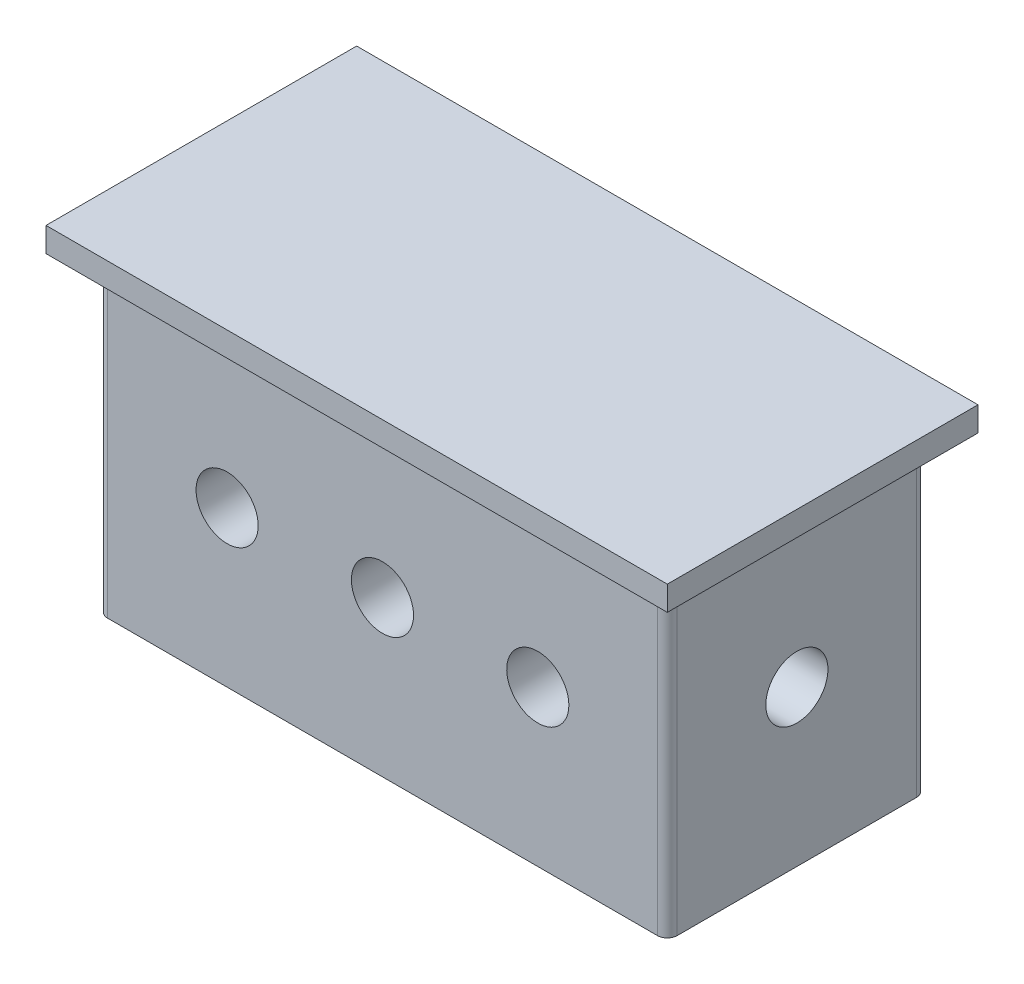
ISO-10303-21;
HEADER;
FILE_DESCRIPTION(('STEP AP214'),'2;1');
FILE_NAME('part.step','',(''),(''),'','','');
FILE_SCHEMA(('AUTOMOTIVE_DESIGN { 1 0 10303 214 1 1 1 1 }'));
ENDSEC;
DATA;
#1=APPLICATION_CONTEXT('core data for automotive mechanical design processes');
#2=APPLICATION_PROTOCOL_DEFINITION('international standard','automotive_design',2000,#1);
#3=PRODUCT_CONTEXT('',#1,'mechanical');
#4=PRODUCT('Part','Part','',(#3));
#5=PRODUCT_RELATED_PRODUCT_CATEGORY('part','',(#4));
#6=PRODUCT_DEFINITION_FORMATION('','',#4);
#7=PRODUCT_DEFINITION_CONTEXT('part definition',#1,'design');
#8=PRODUCT_DEFINITION('design','',#6,#7);
#9=PRODUCT_DEFINITION_SHAPE('','',#8);
#10=(LENGTH_UNIT() NAMED_UNIT(*) SI_UNIT(.MILLI.,.METRE.));
#11=(NAMED_UNIT(*) PLANE_ANGLE_UNIT() SI_UNIT($,.RADIAN.));
#12=(NAMED_UNIT(*) SI_UNIT($,.STERADIAN.) SOLID_ANGLE_UNIT());
#13=UNCERTAINTY_MEASURE_WITH_UNIT(LENGTH_MEASURE(1.E-05),#10,'distance_accuracy_value','');
#14=(GEOMETRIC_REPRESENTATION_CONTEXT(3) GLOBAL_UNCERTAINTY_ASSIGNED_CONTEXT((#13)) GLOBAL_UNIT_ASSIGNED_CONTEXT((#10,
#11,#12)) REPRESENTATION_CONTEXT('',''));
#15=CARTESIAN_POINT('',(0.,0.,0.));
#16=DIRECTION('',(0.,0.,1.));
#17=DIRECTION('',(1.,0.,0.));
#18=AXIS2_PLACEMENT_3D('',#15,#16,#17);
#19=CARTESIAN_POINT('',(0.,-12.7,-12.7));
#20=DIRECTION('',(1.,0.,0.));
#21=DIRECTION('',(0.,0.,-1.));
#22=AXIS2_PLACEMENT_3D('',#19,#20,#21);
#23=CYLINDRICAL_SURFACE('',#22,2.54000000000001);
#24=CARTESIAN_POINT('',(48.6918,-12.7,-12.7));
#25=DIRECTION('',(1.,0.,0.));
#26=DIRECTION('',(0.,0.,-1.));
#27=AXIS2_PLACEMENT_3D('',#24,#25,#26);
#28=CIRCLE('',#27,2.54000000000001);
#29=CARTESIAN_POINT('',(48.6918,-12.7,-15.24));
#30=VERTEX_POINT('',#29);
#31=EDGE_CURVE('E246',#30,#30,#28,.T.);
#32=ORIENTED_EDGE('',*,*,#31,.T.);
#33=EDGE_LOOP('',(#32));
#34=FACE_BOUND('',#33,.T.);
#35=CARTESIAN_POINT('',(38.1,-12.7,-12.7));
#36=DIRECTION('',(0.707106781186547,0.,0.707106781186548));
#37=DIRECTION('',(0.707106781186547,0.,-0.707106781186548));
#38=AXIS2_PLACEMENT_3D('',#35,#36,#37);
#39=ELLIPSE('',#38,3.59210244842768,2.54000000000001);
#40=CARTESIAN_POINT('',(38.1,-10.16,-12.7));
#41=VERTEX_POINT('',#40);
#42=CARTESIAN_POINT('',(38.1,-15.24,-12.7));
#43=VERTEX_POINT('',#42);
#44=EDGE_CURVE('E57',#41,#43,#39,.F.);
#45=ORIENTED_EDGE('',*,*,#44,.T.);
#46=CARTESIAN_POINT('',(38.1,-12.7,-12.7));
#47=DIRECTION('',(0.707106781186547,0.,-0.707106781186548));
#48=DIRECTION('',(0.707106781186547,0.,0.707106781186548));
#49=AXIS2_PLACEMENT_3D('',#46,#47,#48);
#50=ELLIPSE('',#49,3.59210244842768,2.54000000000001);
#51=EDGE_CURVE('E173',#43,#41,#50,.F.);
#52=ORIENTED_EDGE('',*,*,#51,.T.);
#53=EDGE_LOOP('',(#45,#52));
#54=FACE_BOUND('',#53,.T.);
#55=ADVANCED_FACE('F37',(#34,#54),#23,.F.);
#56=CARTESIAN_POINT('',(0.,0.,0.));
#57=DIRECTION('',(0.,1.,0.));
#58=DIRECTION('',(0.,0.,1.));
#59=AXIS2_PLACEMENT_3D('',#56,#57,#58);
#60=PLANE('',#59);
#61=DIRECTION('',(1.,0.,0.));
#62=VECTOR('',#61,1.);
#63=CARTESIAN_POINT('',(0.,0.,0.));
#64=LINE('',#63,#62);
#65=CARTESIAN_POINT('',(0.,0.,0.));
#66=VERTEX_POINT('',#65);
#67=CARTESIAN_POINT('',(50.8,0.,0.));
#68=VERTEX_POINT('',#67);
#69=EDGE_CURVE('E266',#66,#68,#64,.T.);
#70=ORIENTED_EDGE('',*,*,#69,.F.);
#71=DIRECTION('',(0.,0.,-1.));
#72=VECTOR('',#71,1.);
#73=CARTESIAN_POINT('',(0.,0.,0.));
#74=LINE('',#73,#72);
#75=CARTESIAN_POINT('',(0.,0.,-25.4));
#76=VERTEX_POINT('',#75);
#77=EDGE_CURVE('E281',#66,#76,#74,.T.);
#78=ORIENTED_EDGE('',*,*,#77,.T.);
#79=DIRECTION('',(1.,0.,0.));
#80=VECTOR('',#79,1.);
#81=CARTESIAN_POINT('',(0.,0.,-25.4));
#82=LINE('',#81,#80);
#83=CARTESIAN_POINT('',(50.8,0.,-25.4));
#84=VERTEX_POINT('',#83);
#85=EDGE_CURVE('E295',#76,#84,#82,.T.);
#86=ORIENTED_EDGE('',*,*,#85,.T.);
#87=DIRECTION('',(0.,0.,-1.));
#88=VECTOR('',#87,1.);
#89=CARTESIAN_POINT('',(50.8,0.,0.));
#90=LINE('',#89,#88);
#91=EDGE_CURVE('E292',#68,#84,#90,.T.);
#92=ORIENTED_EDGE('',*,*,#91,.F.);
#93=EDGE_LOOP('',(#70,#78,#86,#92));
#94=FACE_BOUND('',#93,.T.);
#95=DIRECTION('',(0.,0.,-1.));
#96=VECTOR('',#95,1.);
#97=CARTESIAN_POINT('',(2.1082,0.,0.));
#98=LINE('',#97,#96);
#99=CARTESIAN_POINT('',(2.1082,0.,-2.91883829787234));
#100=VERTEX_POINT('',#99);
#101=CARTESIAN_POINT('',(2.1082,0.,-22.4811617021277));
#102=VERTEX_POINT('',#101);
#103=EDGE_CURVE('E252',#100,#102,#98,.T.);
#104=ORIENTED_EDGE('',*,*,#103,.F.);
#105=CARTESIAN_POINT('',(2.91883829787234,0.,-2.91883829787234));
#106=DIRECTION('',(0.,1.,0.));
#107=DIRECTION('',(0.,0.,1.));
#108=AXIS2_PLACEMENT_3D('',#105,#106,#107);
#109=CIRCLE('',#108,0.81063829787234);
#110=CARTESIAN_POINT('',(2.91883829787234,0.,-2.1082));
#111=VERTEX_POINT('',#110);
#112=EDGE_CURVE('E340',#100,#111,#109,.T.);
#113=ORIENTED_EDGE('',*,*,#112,.T.);
#114=DIRECTION('',(1.,0.,0.));
#115=VECTOR('',#114,1.);
#116=CARTESIAN_POINT('',(0.,0.,-2.1082));
#117=LINE('',#116,#115);
#118=CARTESIAN_POINT('',(47.8811617021277,0.,-2.1082));
#119=VERTEX_POINT('',#118);
#120=EDGE_CURVE('E269',#111,#119,#117,.T.);
#121=ORIENTED_EDGE('',*,*,#120,.T.);
#122=CARTESIAN_POINT('',(47.8811617021277,0.,-2.91883829787234));
#123=DIRECTION('',(0.,1.,0.));
#124=DIRECTION('',(0.,0.,1.));
#125=AXIS2_PLACEMENT_3D('',#122,#123,#124);
#126=CIRCLE('',#125,0.81063829787234);
#127=CARTESIAN_POINT('',(48.6918,0.,-2.91883829787234));
#128=VERTEX_POINT('',#127);
#129=EDGE_CURVE('E338',#119,#128,#126,.T.);
#130=ORIENTED_EDGE('',*,*,#129,.T.);
#131=DIRECTION('',(0.,0.,-1.));
#132=VECTOR('',#131,1.);
#133=CARTESIAN_POINT('',(48.6918,0.,0.));
#134=LINE('',#133,#132);
#135=CARTESIAN_POINT('',(48.6918,0.,-22.4811617021277));
#136=VERTEX_POINT('',#135);
#137=EDGE_CURVE('E272',#128,#136,#134,.T.);
#138=ORIENTED_EDGE('',*,*,#137,.T.);
#139=CARTESIAN_POINT('',(47.8811617021277,0.,-22.4811617021277));
#140=DIRECTION('',(0.,1.,0.));
#141=DIRECTION('',(0.,0.,1.));
#142=AXIS2_PLACEMENT_3D('',#139,#140,#141);
#143=CIRCLE('',#142,0.81063829787234);
#144=CARTESIAN_POINT('',(47.8811617021277,0.,-23.2918));
#145=VERTEX_POINT('',#144);
#146=EDGE_CURVE('E159',#136,#145,#143,.T.);
#147=ORIENTED_EDGE('',*,*,#146,.T.);
#148=DIRECTION('',(1.,0.,0.));
#149=VECTOR('',#148,1.);
#150=CARTESIAN_POINT('',(0.,0.,-23.2918));
#151=LINE('',#150,#149);
#152=CARTESIAN_POINT('',(2.91883829787234,0.,-23.2918));
#153=VERTEX_POINT('',#152);
#154=EDGE_CURVE('E257',#153,#145,#151,.T.);
#155=ORIENTED_EDGE('',*,*,#154,.F.);
#156=CARTESIAN_POINT('',(2.91883829787234,0.,-22.4811617021277));
#157=DIRECTION('',(0.,1.,0.));
#158=DIRECTION('',(0.,0.,1.));
#159=AXIS2_PLACEMENT_3D('',#156,#157,#158);
#160=CIRCLE('',#159,0.81063829787234);
#161=EDGE_CURVE('E336',#153,#102,#160,.T.);
#162=ORIENTED_EDGE('',*,*,#161,.T.);
#163=EDGE_LOOP('',(#104,#113,#121,#130,#138,#147,#155,#162));
#164=FACE_BOUND('',#163,.T.);
#165=ADVANCED_FACE('F199',(#94,#164),#60,.F.);
#166=CARTESIAN_POINT('',(0.,1.999996,0.));
#167=DIRECTION('',(0.,0.,-1.));
#168=DIRECTION('',(-1.,0.,0.));
#169=AXIS2_PLACEMENT_3D('',#166,#167,#168);
#170=PLANE('',#169);
#171=ORIENTED_EDGE('',*,*,#69,.T.);
#172=DIRECTION('',(0.,-1.,0.));
#173=VECTOR('',#172,1.);
#174=CARTESIAN_POINT('',(50.8,1.999996,0.));
#175=LINE('',#174,#173);
#176=CARTESIAN_POINT('',(50.8,1.999996,0.));
#177=VERTEX_POINT('',#176);
#178=EDGE_CURVE('E305',#177,#68,#175,.T.);
#179=ORIENTED_EDGE('',*,*,#178,.F.);
#180=DIRECTION('',(1.,0.,0.));
#181=VECTOR('',#180,1.);
#182=CARTESIAN_POINT('',(0.,1.999996,0.));
#183=LINE('',#182,#181);
#184=CARTESIAN_POINT('',(0.,1.999996,0.));
#185=VERTEX_POINT('',#184);
#186=EDGE_CURVE('E277',#185,#177,#183,.T.);
#187=ORIENTED_EDGE('',*,*,#186,.F.);
#188=DIRECTION('',(0.,-1.,0.));
#189=VECTOR('',#188,1.);
#190=CARTESIAN_POINT('',(0.,1.999996,0.));
#191=LINE('',#190,#189);
#192=EDGE_CURVE('E289',#185,#66,#191,.T.);
#193=ORIENTED_EDGE('',*,*,#192,.T.);
#194=EDGE_LOOP('',(#171,#179,#187,#193));
#195=FACE_BOUND('',#194,.T.);
#196=ADVANCED_FACE('F386',(#195),#170,.F.);
#197=CARTESIAN_POINT('',(50.8,1.999996,0.));
#198=DIRECTION('',(-1.,0.,0.));
#199=DIRECTION('',(0.,0.,1.));
#200=AXIS2_PLACEMENT_3D('',#197,#198,#199);
#201=PLANE('',#200);
#202=ORIENTED_EDGE('',*,*,#91,.T.);
#203=DIRECTION('',(0.,-1.,0.));
#204=VECTOR('',#203,1.);
#205=CARTESIAN_POINT('',(50.8,1.999996,-25.4));
#206=LINE('',#205,#204);
#207=CARTESIAN_POINT('',(50.8,1.999996,-25.4));
#208=VERTEX_POINT('',#207);
#209=EDGE_CURVE('E303',#208,#84,#206,.T.);
#210=ORIENTED_EDGE('',*,*,#209,.F.);
#211=DIRECTION('',(0.,0.,-1.));
#212=VECTOR('',#211,1.);
#213=CARTESIAN_POINT('',(50.8,1.999996,0.));
#214=LINE('',#213,#212);
#215=EDGE_CURVE('E280',#177,#208,#214,.T.);
#216=ORIENTED_EDGE('',*,*,#215,.F.);
#217=ORIENTED_EDGE('',*,*,#178,.T.);
#218=EDGE_LOOP('',(#202,#210,#216,#217));
#219=FACE_BOUND('',#218,.T.);
#220=ADVANCED_FACE('F546',(#219),#201,.F.);
#221=CARTESIAN_POINT('',(0.,1.999996,-25.4));
#222=DIRECTION('',(0.,0.,-1.));
#223=DIRECTION('',(-1.,0.,0.));
#224=AXIS2_PLACEMENT_3D('',#221,#222,#223);
#225=PLANE('',#224);
#226=ORIENTED_EDGE('',*,*,#85,.F.);
#227=DIRECTION('',(0.,-1.,0.));
#228=VECTOR('',#227,1.);
#229=CARTESIAN_POINT('',(0.,1.999996,-25.4));
#230=LINE('',#229,#228);
#231=CARTESIAN_POINT('',(0.,1.999996,-25.4));
#232=VERTEX_POINT('',#231);
#233=EDGE_CURVE('E301',#232,#76,#230,.T.);
#234=ORIENTED_EDGE('',*,*,#233,.F.);
#235=DIRECTION('',(1.,0.,0.));
#236=VECTOR('',#235,1.);
#237=CARTESIAN_POINT('',(0.,1.999996,-25.4));
#238=LINE('',#237,#236);
#239=EDGE_CURVE('E283',#232,#208,#238,.T.);
#240=ORIENTED_EDGE('',*,*,#239,.T.);
#241=ORIENTED_EDGE('',*,*,#209,.T.);
#242=EDGE_LOOP('',(#226,#234,#240,#241));
#243=FACE_BOUND('',#242,.T.);
#244=ADVANCED_FACE('F536',(#243),#225,.T.);
#245=CARTESIAN_POINT('',(0.,1.999996,0.));
#246=DIRECTION('',(-1.,0.,0.));
#247=DIRECTION('',(0.,0.,1.));
#248=AXIS2_PLACEMENT_3D('',#245,#246,#247);
#249=PLANE('',#248);
#250=ORIENTED_EDGE('',*,*,#77,.F.);
#251=ORIENTED_EDGE('',*,*,#192,.F.);
#252=DIRECTION('',(0.,0.,-1.));
#253=VECTOR('',#252,1.);
#254=CARTESIAN_POINT('',(0.,1.999996,0.));
#255=LINE('',#254,#253);
#256=EDGE_CURVE('E286',#185,#232,#255,.T.);
#257=ORIENTED_EDGE('',*,*,#256,.T.);
#258=ORIENTED_EDGE('',*,*,#233,.T.);
#259=EDGE_LOOP('',(#250,#251,#257,#258));
#260=FACE_BOUND('',#259,.T.);
#261=ADVANCED_FACE('F526',(#260),#249,.T.);
#262=CARTESIAN_POINT('',(0.,1.999996,0.));
#263=DIRECTION('',(0.,1.,0.));
#264=DIRECTION('',(0.,0.,1.));
#265=AXIS2_PLACEMENT_3D('',#262,#263,#264);
#266=PLANE('',#265);
#267=ORIENTED_EDGE('',*,*,#186,.T.);
#268=ORIENTED_EDGE('',*,*,#215,.T.);
#269=ORIENTED_EDGE('',*,*,#239,.F.);
#270=ORIENTED_EDGE('',*,*,#256,.F.);
#271=EDGE_LOOP('',(#267,#268,#269,#270));
#272=FACE_BOUND('',#271,.T.);
#273=ADVANCED_FACE('F407',(#272),#266,.T.);
#274=CARTESIAN_POINT('',(2.1082,-25.4,0.));
#275=DIRECTION('',(1.,0.,0.));
#276=DIRECTION('',(0.,0.,-1.));
#277=AXIS2_PLACEMENT_3D('',#274,#275,#276);
#278=PLANE('',#277);
#279=CARTESIAN_POINT('',(2.1082,-12.7,-12.7));
#280=DIRECTION('',(1.,0.,0.));
#281=DIRECTION('',(0.,0.,-1.));
#282=AXIS2_PLACEMENT_3D('',#279,#280,#281);
#283=CIRCLE('',#282,2.54000000000001);
#284=CARTESIAN_POINT('',(2.1082,-12.7,-15.24));
#285=VERTEX_POINT('',#284);
#286=EDGE_CURVE('E249',#285,#285,#283,.T.);
#287=ORIENTED_EDGE('',*,*,#286,.T.);
#288=EDGE_LOOP('',(#287));
#289=FACE_BOUND('',#288,.T.);
#290=ORIENTED_EDGE('',*,*,#103,.T.);
#291=DIRECTION('',(0.,1.,0.));
#292=VECTOR('',#291,1.);
#293=CARTESIAN_POINT('',(2.1082,-25.4,-22.4811617021277));
#294=LINE('',#293,#292);
#295=CARTESIAN_POINT('',(2.1082,-25.4,-22.4811617021277));
#296=VERTEX_POINT('',#295);
#297=EDGE_CURVE('E316',#102,#296,#294,.F.);
#298=ORIENTED_EDGE('',*,*,#297,.T.);
#299=DIRECTION('',(0.,0.,-1.));
#300=VECTOR('',#299,1.);
#301=CARTESIAN_POINT('',(2.1082,-25.4,0.));
#302=LINE('',#301,#300);
#303=CARTESIAN_POINT('',(2.1082,-25.4,-2.91883829787234));
#304=VERTEX_POINT('',#303);
#305=EDGE_CURVE('E253',#304,#296,#302,.T.);
#306=ORIENTED_EDGE('',*,*,#305,.F.);
#307=DIRECTION('',(0.,1.,0.));
#308=VECTOR('',#307,1.);
#309=CARTESIAN_POINT('',(2.1082,0.,-2.91883829787234));
#310=LINE('',#309,#308);
#311=EDGE_CURVE('E313',#304,#100,#310,.T.);
#312=ORIENTED_EDGE('',*,*,#311,.T.);
#313=EDGE_LOOP('',(#290,#298,#306,#312));
#314=FACE_BOUND('',#313,.T.);
#315=ADVANCED_FACE('F374',(#289,#314),#278,.F.);
#316=CARTESIAN_POINT('',(0.,-25.4,-23.2918));
#317=DIRECTION('',(0.,0.,1.));
#318=DIRECTION('',(1.,0.,0.));
#319=AXIS2_PLACEMENT_3D('',#316,#317,#318);
#320=PLANE('',#319);
#321=CARTESIAN_POINT('',(12.7,-12.7,-23.2918));
#322=DIRECTION('',(0.,0.,-1.));
#323=DIRECTION('',(-1.,0.,0.));
#324=AXIS2_PLACEMENT_3D('',#321,#322,#323);
#325=CIRCLE('',#324,2.54000000000001);
#326=CARTESIAN_POINT('',(10.16,-12.7,-23.2918));
#327=VERTEX_POINT('',#326);
#328=EDGE_CURVE('E230',#327,#327,#325,.T.);
#329=ORIENTED_EDGE('',*,*,#328,.F.);
#330=EDGE_LOOP('',(#329));
#331=FACE_BOUND('',#330,.T.);
#332=CARTESIAN_POINT('',(38.1,-12.7,-23.2918));
#333=DIRECTION('',(0.,0.,-1.));
#334=DIRECTION('',(-1.,0.,0.));
#335=AXIS2_PLACEMENT_3D('',#332,#333,#334);
#336=CIRCLE('',#335,2.54000000000002);
#337=CARTESIAN_POINT('',(35.56,-12.7,-23.2918));
#338=VERTEX_POINT('',#337);
#339=EDGE_CURVE('E227',#338,#338,#336,.T.);
#340=ORIENTED_EDGE('',*,*,#339,.F.);
#341=EDGE_LOOP('',(#340));
#342=FACE_BOUND('',#341,.T.);
#343=CARTESIAN_POINT('',(25.4,-12.7,-23.2918));
#344=DIRECTION('',(0.,0.,-1.));
#345=DIRECTION('',(-1.,0.,0.));
#346=AXIS2_PLACEMENT_3D('',#343,#344,#345);
#347=CIRCLE('',#346,2.54);
#348=CARTESIAN_POINT('',(22.86,-12.7,-23.2918));
#349=VERTEX_POINT('',#348);
#350=EDGE_CURVE('E229',#349,#349,#347,.T.);
#351=ORIENTED_EDGE('',*,*,#350,.F.);
#352=EDGE_LOOP('',(#351));
#353=FACE_BOUND('',#352,.T.);
#354=DIRECTION('',(1.,0.,0.));
#355=VECTOR('',#354,1.);
#356=CARTESIAN_POINT('',(0.,-25.4,-23.2918));
#357=LINE('',#356,#355);
#358=CARTESIAN_POINT('',(2.91883829787234,-25.4,-23.2918));
#359=VERTEX_POINT('',#358);
#360=CARTESIAN_POINT('',(47.8811617021277,-25.4,-23.2918));
#361=VERTEX_POINT('',#360);
#362=EDGE_CURVE('E263',#359,#361,#357,.T.);
#363=ORIENTED_EDGE('',*,*,#362,.F.);
#364=DIRECTION('',(0.,1.,0.));
#365=VECTOR('',#364,1.);
#366=CARTESIAN_POINT('',(2.91883829787234,-25.4,-23.2918));
#367=LINE('',#366,#365);
#368=EDGE_CURVE('E310',#359,#153,#367,.T.);
#369=ORIENTED_EDGE('',*,*,#368,.T.);
#370=ORIENTED_EDGE('',*,*,#154,.T.);
#371=DIRECTION('',(0.,1.,0.));
#372=VECTOR('',#371,1.);
#373=CARTESIAN_POINT('',(47.8811617021277,-25.4,-23.2918));
#374=LINE('',#373,#372);
#375=EDGE_CURVE('E308',#145,#361,#374,.F.);
#376=ORIENTED_EDGE('',*,*,#375,.T.);
#377=EDGE_LOOP('',(#363,#369,#370,#376));
#378=FACE_BOUND('',#377,.T.);
#379=ADVANCED_FACE('F350',(#331,#342,#353,#378),#320,.F.);
#380=CARTESIAN_POINT('',(48.6918,-25.4,0.));
#381=DIRECTION('',(1.,0.,0.));
#382=DIRECTION('',(0.,0.,-1.));
#383=AXIS2_PLACEMENT_3D('',#380,#381,#382);
#384=PLANE('',#383);
#385=ORIENTED_EDGE('',*,*,#31,.F.);
#386=EDGE_LOOP('',(#385));
#387=FACE_BOUND('',#386,.T.);
#388=ORIENTED_EDGE('',*,*,#137,.F.);
#389=DIRECTION('',(0.,1.,0.));
#390=VECTOR('',#389,1.);
#391=CARTESIAN_POINT('',(48.6918,-25.4,-2.91883829787234));
#392=LINE('',#391,#390);
#393=CARTESIAN_POINT('',(48.6918,-25.4,-2.91883829787234));
#394=VERTEX_POINT('',#393);
#395=EDGE_CURVE('E334',#128,#394,#392,.F.);
#396=ORIENTED_EDGE('',*,*,#395,.T.);
#397=DIRECTION('',(0.,0.,-1.));
#398=VECTOR('',#397,1.);
#399=CARTESIAN_POINT('',(48.6918,-25.4,0.));
#400=LINE('',#399,#398);
#401=CARTESIAN_POINT('',(48.6918,-25.4,-22.4811617021277));
#402=VERTEX_POINT('',#401);
#403=EDGE_CURVE('E260',#394,#402,#400,.T.);
#404=ORIENTED_EDGE('',*,*,#403,.T.);
#405=DIRECTION('',(0.,1.,0.));
#406=VECTOR('',#405,1.);
#407=CARTESIAN_POINT('',(48.6918,0.,-22.4811617021277));
#408=LINE('',#407,#406);
#409=EDGE_CURVE('E331',#402,#136,#408,.T.);
#410=ORIENTED_EDGE('',*,*,#409,.T.);
#411=EDGE_LOOP('',(#388,#396,#404,#410));
#412=FACE_BOUND('',#411,.T.);
#413=ADVANCED_FACE('F358',(#387,#412),#384,.T.);
#414=CARTESIAN_POINT('',(0.,-25.4,-2.1082));
#415=DIRECTION('',(0.,0.,1.));
#416=DIRECTION('',(1.,0.,0.));
#417=AXIS2_PLACEMENT_3D('',#414,#415,#416);
#418=PLANE('',#417);
#419=CARTESIAN_POINT('',(12.7,-12.7,-2.1082));
#420=DIRECTION('',(0.,0.,1.));
#421=DIRECTION('',(1.,0.,0.));
#422=AXIS2_PLACEMENT_3D('',#419,#420,#421);
#423=CIRCLE('',#422,2.54000000000001);
#424=CARTESIAN_POINT('',(15.24,-12.7,-2.1082));
#425=VERTEX_POINT('',#424);
#426=EDGE_CURVE('E243',#425,#425,#423,.T.);
#427=ORIENTED_EDGE('',*,*,#426,.F.);
#428=EDGE_LOOP('',(#427));
#429=FACE_BOUND('',#428,.T.);
#430=CARTESIAN_POINT('',(38.1,-12.7,-2.1082));
#431=DIRECTION('',(0.,0.,1.));
#432=DIRECTION('',(1.,0.,0.));
#433=AXIS2_PLACEMENT_3D('',#430,#431,#432);
#434=CIRCLE('',#433,2.54000000000002);
#435=CARTESIAN_POINT('',(40.64,-12.7,-2.1082));
#436=VERTEX_POINT('',#435);
#437=EDGE_CURVE('E240',#436,#436,#434,.T.);
#438=ORIENTED_EDGE('',*,*,#437,.F.);
#439=EDGE_LOOP('',(#438));
#440=FACE_BOUND('',#439,.T.);
#441=CARTESIAN_POINT('',(25.4,-12.7,-2.1082));
#442=DIRECTION('',(0.,0.,1.));
#443=DIRECTION('',(1.,0.,0.));
#444=AXIS2_PLACEMENT_3D('',#441,#442,#443);
#445=CIRCLE('',#444,2.54);
#446=CARTESIAN_POINT('',(27.94,-12.7,-2.1082));
#447=VERTEX_POINT('',#446);
#448=EDGE_CURVE('E233',#447,#447,#445,.T.);
#449=ORIENTED_EDGE('',*,*,#448,.F.);
#450=EDGE_LOOP('',(#449));
#451=FACE_BOUND('',#450,.T.);
#452=DIRECTION('',(1.,0.,0.));
#453=VECTOR('',#452,1.);
#454=CARTESIAN_POINT('',(0.,-25.4,-2.1082));
#455=LINE('',#454,#453);
#456=CARTESIAN_POINT('',(2.91883829787234,-25.4,-2.1082));
#457=VERTEX_POINT('',#456);
#458=CARTESIAN_POINT('',(47.8811617021277,-25.4,-2.1082));
#459=VERTEX_POINT('',#458);
#460=EDGE_CURVE('E256',#457,#459,#455,.T.);
#461=ORIENTED_EDGE('',*,*,#460,.T.);
#462=DIRECTION('',(0.,1.,0.));
#463=VECTOR('',#462,1.);
#464=CARTESIAN_POINT('',(47.8811617021277,-25.4,-2.1082));
#465=LINE('',#464,#463);
#466=EDGE_CURVE('E328',#459,#119,#465,.T.);
#467=ORIENTED_EDGE('',*,*,#466,.T.);
#468=ORIENTED_EDGE('',*,*,#120,.F.);
#469=DIRECTION('',(0.,1.,0.));
#470=VECTOR('',#469,1.);
#471=CARTESIAN_POINT('',(2.91883829787234,-25.4,-2.1082));
#472=LINE('',#471,#470);
#473=EDGE_CURVE('E326',#111,#457,#472,.F.);
#474=ORIENTED_EDGE('',*,*,#473,.T.);
#475=EDGE_LOOP('',(#461,#467,#468,#474));
#476=FACE_BOUND('',#475,.T.);
#477=ADVANCED_FACE('F366',(#429,#440,#451,#476),#418,.T.);
#478=CARTESIAN_POINT('',(0.,-25.4,0.));
#479=DIRECTION('',(0.,1.,0.));
#480=DIRECTION('',(0.,0.,1.));
#481=AXIS2_PLACEMENT_3D('',#478,#479,#480);
#482=PLANE('',#481);
#483=ORIENTED_EDGE('',*,*,#305,.T.);
#484=CARTESIAN_POINT('',(2.91883829787234,-25.4,-22.4811617021277));
#485=DIRECTION('',(0.,1.,0.));
#486=DIRECTION('',(0.,0.,1.));
#487=AXIS2_PLACEMENT_3D('',#484,#485,#486);
#488=CIRCLE('',#487,0.81063829787234);
#489=EDGE_CURVE('E324',#296,#359,#488,.F.);
#490=ORIENTED_EDGE('',*,*,#489,.T.);
#491=ORIENTED_EDGE('',*,*,#362,.T.);
#492=CARTESIAN_POINT('',(47.8811617021277,-25.4,-22.4811617021277));
#493=DIRECTION('',(0.,1.,0.));
#494=DIRECTION('',(0.,0.,1.));
#495=AXIS2_PLACEMENT_3D('',#492,#493,#494);
#496=CIRCLE('',#495,0.81063829787234);
#497=EDGE_CURVE('E318',#361,#402,#496,.F.);
#498=ORIENTED_EDGE('',*,*,#497,.T.);
#499=ORIENTED_EDGE('',*,*,#403,.F.);
#500=CARTESIAN_POINT('',(47.8811617021277,-25.4,-2.91883829787234));
#501=DIRECTION('',(0.,1.,0.));
#502=DIRECTION('',(0.,0.,1.));
#503=AXIS2_PLACEMENT_3D('',#500,#501,#502);
#504=CIRCLE('',#503,0.81063829787234);
#505=EDGE_CURVE('E322',#394,#459,#504,.F.);
#506=ORIENTED_EDGE('',*,*,#505,.T.);
#507=ORIENTED_EDGE('',*,*,#460,.F.);
#508=CARTESIAN_POINT('',(2.91883829787234,-25.4,-2.91883829787234));
#509=DIRECTION('',(0.,1.,0.));
#510=DIRECTION('',(0.,0.,1.));
#511=AXIS2_PLACEMENT_3D('',#508,#509,#510);
#512=CIRCLE('',#511,0.81063829787234);
#513=EDGE_CURVE('E320',#457,#304,#512,.F.);
#514=ORIENTED_EDGE('',*,*,#513,.T.);
#515=EDGE_LOOP('',(#483,#490,#491,#498,#499,#506,#507,#514));
#516=FACE_BOUND('',#515,.T.);
#517=ADVANCED_FACE('F355',(#516),#482,.F.);
#518=CARTESIAN_POINT('',(2.91883829787234,-25.4,-22.4811617021277));
#519=DIRECTION('',(0.,1.,0.));
#520=DIRECTION('',(0.,0.,1.));
#521=AXIS2_PLACEMENT_3D('',#518,#519,#520);
#522=CYLINDRICAL_SURFACE('',#521,0.81063829787234);
#523=ORIENTED_EDGE('',*,*,#489,.F.);
#524=ORIENTED_EDGE('',*,*,#297,.F.);
#525=ORIENTED_EDGE('',*,*,#161,.F.);
#526=ORIENTED_EDGE('',*,*,#368,.F.);
#527=EDGE_LOOP('',(#523,#524,#525,#526));
#528=FACE_BOUND('',#527,.T.);
#529=ADVANCED_FACE('F377',(#528),#522,.T.);
#530=CARTESIAN_POINT('',(47.8811617021277,-25.4,-2.91883829787234));
#531=DIRECTION('',(0.,1.,0.));
#532=DIRECTION('',(0.,0.,1.));
#533=AXIS2_PLACEMENT_3D('',#530,#531,#532);
#534=CYLINDRICAL_SURFACE('',#533,0.81063829787234);
#535=ORIENTED_EDGE('',*,*,#505,.F.);
#536=ORIENTED_EDGE('',*,*,#395,.F.);
#537=ORIENTED_EDGE('',*,*,#129,.F.);
#538=ORIENTED_EDGE('',*,*,#466,.F.);
#539=EDGE_LOOP('',(#535,#536,#537,#538));
#540=FACE_BOUND('',#539,.T.);
#541=ADVANCED_FACE('F361',(#540),#534,.T.);
#542=CARTESIAN_POINT('',(2.91883829787234,-25.4,-2.91883829787234));
#543=DIRECTION('',(0.,-1.,0.));
#544=DIRECTION('',(0.,0.,-1.));
#545=AXIS2_PLACEMENT_3D('',#542,#543,#544);
#546=CYLINDRICAL_SURFACE('',#545,0.81063829787234);
#547=ORIENTED_EDGE('',*,*,#513,.F.);
#548=ORIENTED_EDGE('',*,*,#473,.F.);
#549=ORIENTED_EDGE('',*,*,#112,.F.);
#550=ORIENTED_EDGE('',*,*,#311,.F.);
#551=EDGE_LOOP('',(#547,#548,#549,#550));
#552=FACE_BOUND('',#551,.T.);
#553=ADVANCED_FACE('F205',(#552),#546,.T.);
#554=CARTESIAN_POINT('',(47.8811617021277,-25.4,-22.4811617021277));
#555=DIRECTION('',(0.,-1.,0.));
#556=DIRECTION('',(0.,0.,-1.));
#557=AXIS2_PLACEMENT_3D('',#554,#555,#556);
#558=CYLINDRICAL_SURFACE('',#557,0.81063829787234);
#559=ORIENTED_EDGE('',*,*,#497,.F.);
#560=ORIENTED_EDGE('',*,*,#375,.F.);
#561=ORIENTED_EDGE('',*,*,#146,.F.);
#562=ORIENTED_EDGE('',*,*,#409,.F.);
#563=EDGE_LOOP('',(#559,#560,#561,#562));
#564=FACE_BOUND('',#563,.T.);
#565=ADVANCED_FACE('F39',(#564),#558,.T.);
#566=CARTESIAN_POINT('',(12.7,-12.7,-12.7));
#567=DIRECTION('',(0.707106781186547,0.,0.707106781186548));
#568=DIRECTION('',(0.707106781186547,0.,-0.707106781186548));
#569=AXIS2_PLACEMENT_3D('',#566,#567,#568);
#570=ELLIPSE('',#569,3.59210244842767,2.54000000000001);
#571=CARTESIAN_POINT('',(12.7,-10.16,-12.7));
#572=VERTEX_POINT('',#571);
#573=CARTESIAN_POINT('',(12.7,-15.24,-12.7));
#574=VERTEX_POINT('',#573);
#575=EDGE_CURVE('E176',#572,#574,#570,.T.);
#576=ORIENTED_EDGE('',*,*,#575,.T.);
#577=CARTESIAN_POINT('',(12.7,-12.7,-12.7));
#578=DIRECTION('',(0.707106781186547,0.,-0.707106781186548));
#579=DIRECTION('',(0.707106781186547,0.,0.707106781186548));
#580=AXIS2_PLACEMENT_3D('',#577,#578,#579);
#581=ELLIPSE('',#580,3.59210244842767,2.54000000000001);
#582=EDGE_CURVE('E45',#574,#572,#581,.T.);
#583=ORIENTED_EDGE('',*,*,#582,.T.);
#584=EDGE_LOOP('',(#576,#583));
#585=FACE_BOUND('',#584,.T.);
#586=ORIENTED_EDGE('',*,*,#286,.F.);
#587=EDGE_LOOP('',(#586));
#588=FACE_BOUND('',#587,.T.);
#589=ADVANCED_FACE('F180',(#585,#588),#23,.F.);
#590=CARTESIAN_POINT('',(25.4,-12.7,0.));
#591=DIRECTION('',(0.,0.,-1.));
#592=DIRECTION('',(-1.,0.,0.));
#593=AXIS2_PLACEMENT_3D('',#590,#591,#592);
#594=CYLINDRICAL_SURFACE('',#593,2.54);
#595=ORIENTED_EDGE('',*,*,#350,.T.);
#596=EDGE_LOOP('',(#595));
#597=FACE_BOUND('',#596,.T.);
#598=CARTESIAN_POINT('',(25.4,-12.7,-12.7));
#599=DIRECTION('',(0.707106781186547,0.,0.707106781186548));
#600=DIRECTION('',(0.707106781186547,0.,-0.707106781186548));
#601=AXIS2_PLACEMENT_3D('',#598,#599,#600);
#602=ELLIPSE('',#601,3.59210244842767,2.54);
#603=CARTESIAN_POINT('',(25.4,-10.16,-12.7));
#604=VERTEX_POINT('',#603);
#605=CARTESIAN_POINT('',(25.4,-15.24,-12.7));
#606=VERTEX_POINT('',#605);
#607=EDGE_CURVE('E153',#604,#606,#602,.F.);
#608=ORIENTED_EDGE('',*,*,#607,.F.);
#609=CARTESIAN_POINT('',(25.4,-12.7,-12.7));
#610=DIRECTION('',(0.707106781186547,0.,-0.707106781186548));
#611=DIRECTION('',(0.707106781186547,0.,0.707106781186548));
#612=AXIS2_PLACEMENT_3D('',#609,#610,#611);
#613=ELLIPSE('',#612,3.59210244842767,2.54);
#614=EDGE_CURVE('E152',#606,#604,#613,.T.);
#615=ORIENTED_EDGE('',*,*,#614,.F.);
#616=EDGE_LOOP('',(#608,#615));
#617=FACE_BOUND('',#616,.T.);
#618=ADVANCED_FACE('F157',(#597,#617),#594,.F.);
#619=CARTESIAN_POINT('',(25.4,-12.7,-12.7));
#620=DIRECTION('',(0.707106781186547,0.,0.707106781186548));
#621=DIRECTION('',(0.707106781186547,0.,-0.707106781186548));
#622=AXIS2_PLACEMENT_3D('',#619,#620,#621);
#623=ELLIPSE('',#622,3.59210244842767,2.54);
#624=EDGE_CURVE('E145',#604,#606,#623,.T.);
#625=ORIENTED_EDGE('',*,*,#624,.T.);
#626=ORIENTED_EDGE('',*,*,#614,.T.);
#627=EDGE_LOOP('',(#625,#626));
#628=FACE_BOUND('',#627,.T.);
#629=CARTESIAN_POINT('',(12.7,-12.7,-12.7));
#630=DIRECTION('',(0.707106781186547,0.,0.707106781186548));
#631=DIRECTION('',(0.707106781186547,0.,-0.707106781186548));
#632=AXIS2_PLACEMENT_3D('',#629,#630,#631);
#633=ELLIPSE('',#632,3.59210244842767,2.54000000000001);
#634=EDGE_CURVE('E50',#572,#574,#633,.F.);
#635=ORIENTED_EDGE('',*,*,#634,.T.);
#636=CARTESIAN_POINT('',(12.7,-12.7,-12.7));
#637=DIRECTION('',(0.707106781186547,0.,-0.707106781186548));
#638=DIRECTION('',(0.707106781186547,0.,0.707106781186548));
#639=AXIS2_PLACEMENT_3D('',#636,#637,#638);
#640=ELLIPSE('',#639,3.59210244842767,2.54000000000001);
#641=EDGE_CURVE('E11',#574,#572,#640,.F.);
#642=ORIENTED_EDGE('',*,*,#641,.T.);
#643=EDGE_LOOP('',(#635,#642));
#644=FACE_BOUND('',#643,.T.);
#645=ADVANCED_FACE('F163',(#628,#644),#23,.F.);
#646=ORIENTED_EDGE('',*,*,#448,.T.);
#647=EDGE_LOOP('',(#646));
#648=FACE_BOUND('',#647,.T.);
#649=ORIENTED_EDGE('',*,*,#624,.F.);
#650=CARTESIAN_POINT('',(25.4,-12.7,-12.7));
#651=DIRECTION('',(0.707106781186547,0.,-0.707106781186548));
#652=DIRECTION('',(0.707106781186547,0.,0.707106781186548));
#653=AXIS2_PLACEMENT_3D('',#650,#651,#652);
#654=ELLIPSE('',#653,3.59210244842767,2.54);
#655=EDGE_CURVE('E149',#606,#604,#654,.F.);
#656=ORIENTED_EDGE('',*,*,#655,.F.);
#657=EDGE_LOOP('',(#649,#656));
#658=FACE_BOUND('',#657,.T.);
#659=ADVANCED_FACE('F147',(#648,#658),#594,.F.);
#660=CARTESIAN_POINT('',(38.1,-12.7,0.));
#661=DIRECTION('',(0.,0.,-1.));
#662=DIRECTION('',(-1.,0.,0.));
#663=AXIS2_PLACEMENT_3D('',#660,#661,#662);
#664=CYLINDRICAL_SURFACE('',#663,2.54000000000002);
#665=ORIENTED_EDGE('',*,*,#339,.T.);
#666=EDGE_LOOP('',(#665));
#667=FACE_BOUND('',#666,.T.);
#668=ORIENTED_EDGE('',*,*,#44,.F.);
#669=CARTESIAN_POINT('',(38.1,-12.7,-12.7));
#670=DIRECTION('',(0.707106781186547,0.,-0.707106781186548));
#671=DIRECTION('',(0.707106781186547,0.,0.707106781186548));
#672=AXIS2_PLACEMENT_3D('',#669,#670,#671);
#673=ELLIPSE('',#672,3.59210244842768,2.54000000000001);
#674=EDGE_CURVE('E170',#43,#41,#673,.T.);
#675=ORIENTED_EDGE('',*,*,#674,.F.);
#676=EDGE_LOOP('',(#668,#675));
#677=FACE_BOUND('',#676,.T.);
#678=ADVANCED_FACE('F193',(#667,#677),#664,.F.);
#679=ORIENTED_EDGE('',*,*,#437,.T.);
#680=EDGE_LOOP('',(#679));
#681=FACE_BOUND('',#680,.T.);
#682=CARTESIAN_POINT('',(38.1,-12.7,-12.7));
#683=DIRECTION('',(0.707106781186547,0.,0.707106781186548));
#684=DIRECTION('',(0.707106781186547,0.,-0.707106781186548));
#685=AXIS2_PLACEMENT_3D('',#682,#683,#684);
#686=ELLIPSE('',#685,3.59210244842768,2.54000000000001);
#687=EDGE_CURVE('E167',#41,#43,#686,.T.);
#688=ORIENTED_EDGE('',*,*,#687,.F.);
#689=ORIENTED_EDGE('',*,*,#51,.F.);
#690=EDGE_LOOP('',(#688,#689));
#691=FACE_BOUND('',#690,.T.);
#692=ADVANCED_FACE('F216',(#681,#691),#664,.F.);
#693=CARTESIAN_POINT('',(12.7,-12.7,0.));
#694=DIRECTION('',(0.,0.,-1.));
#695=DIRECTION('',(-1.,0.,0.));
#696=AXIS2_PLACEMENT_3D('',#693,#694,#695);
#697=CYLINDRICAL_SURFACE('',#696,2.54000000000001);
#698=ORIENTED_EDGE('',*,*,#328,.T.);
#699=EDGE_LOOP('',(#698));
#700=FACE_BOUND('',#699,.T.);
#701=ORIENTED_EDGE('',*,*,#634,.F.);
#702=ORIENTED_EDGE('',*,*,#582,.F.);
#703=EDGE_LOOP('',(#701,#702));
#704=FACE_BOUND('',#703,.T.);
#705=ADVANCED_FACE('F184',(#700,#704),#697,.F.);
#706=ORIENTED_EDGE('',*,*,#426,.T.);
#707=EDGE_LOOP('',(#706));
#708=FACE_BOUND('',#707,.T.);
#709=ORIENTED_EDGE('',*,*,#575,.F.);
#710=ORIENTED_EDGE('',*,*,#641,.F.);
#711=EDGE_LOOP('',(#709,#710));
#712=FACE_BOUND('',#711,.T.);
#713=ADVANCED_FACE('F186',(#708,#712),#697,.F.);
#714=ORIENTED_EDGE('',*,*,#687,.T.);
#715=ORIENTED_EDGE('',*,*,#674,.T.);
#716=EDGE_LOOP('',(#714,#715));
#717=FACE_BOUND('',#716,.T.);
#718=ORIENTED_EDGE('',*,*,#607,.T.);
#719=ORIENTED_EDGE('',*,*,#655,.T.);
#720=EDGE_LOOP('',(#718,#719));
#721=FACE_BOUND('',#720,.T.);
#722=ADVANCED_FACE('F161',(#717,#721),#23,.F.);
#723=CLOSED_SHELL('',(#55,#165,#196,#220,#244,#261,#273,#315,#379,#413,#477,#517,#529,#541,#553,
#565,#589,#618,#645,#659,#678,#692,#705,#713,#722));
#724=MANIFOLD_SOLID_BREP('B2',#723);
#725=ADVANCED_BREP_SHAPE_REPRESENTATION('',(#18,#724),#14);
#726=SHAPE_DEFINITION_REPRESENTATION(#9,#725);
ENDSEC;
END-ISO-10303-21;
